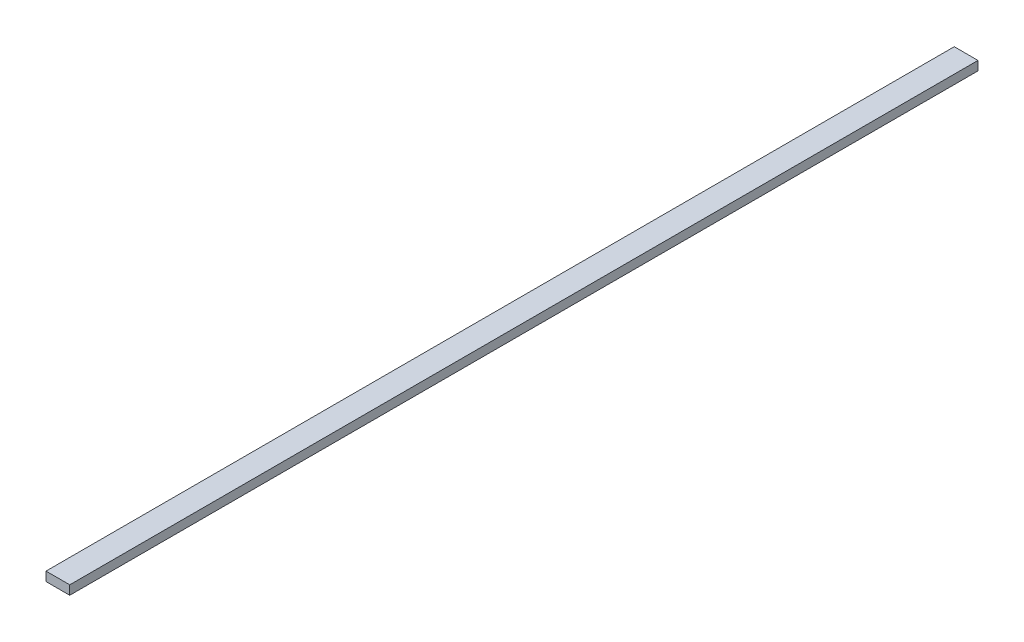
ISO-10303-21;
HEADER;
FILE_DESCRIPTION(('STEP AP214'),'2;1');
FILE_NAME('part.step','',(''),(''),'','','');
FILE_SCHEMA(('AUTOMOTIVE_DESIGN { 1 0 10303 214 1 1 1 1 }'));
ENDSEC;
DATA;
#1=APPLICATION_CONTEXT('core data for automotive mechanical design processes');
#2=APPLICATION_PROTOCOL_DEFINITION('international standard','automotive_design',2000,#1);
#3=PRODUCT_CONTEXT('',#1,'mechanical');
#4=PRODUCT('Part','Part','',(#3));
#5=PRODUCT_RELATED_PRODUCT_CATEGORY('part','',(#4));
#6=PRODUCT_DEFINITION_FORMATION('','',#4);
#7=PRODUCT_DEFINITION_CONTEXT('part definition',#1,'design');
#8=PRODUCT_DEFINITION('design','',#6,#7);
#9=PRODUCT_DEFINITION_SHAPE('','',#8);
#10=(LENGTH_UNIT() NAMED_UNIT(*) SI_UNIT(.MILLI.,.METRE.));
#11=(NAMED_UNIT(*) PLANE_ANGLE_UNIT() SI_UNIT($,.RADIAN.));
#12=(NAMED_UNIT(*) SI_UNIT($,.STERADIAN.) SOLID_ANGLE_UNIT());
#13=UNCERTAINTY_MEASURE_WITH_UNIT(LENGTH_MEASURE(1.E-05),#10,'distance_accuracy_value','');
#14=(GEOMETRIC_REPRESENTATION_CONTEXT(3) GLOBAL_UNCERTAINTY_ASSIGNED_CONTEXT((#13)) GLOBAL_UNIT_ASSIGNED_CONTEXT((#10,
#11,#12)) REPRESENTATION_CONTEXT('',''));
#15=CARTESIAN_POINT('',(0.,0.,0.));
#16=DIRECTION('',(0.,0.,1.));
#17=DIRECTION('',(1.,0.,0.));
#18=AXIS2_PLACEMENT_3D('',#15,#16,#17);
#19=CARTESIAN_POINT('',(9.15,-3.5,350.));
#20=DIRECTION('',(-1.,0.,0.));
#21=DIRECTION('',(0.,0.,1.));
#22=AXIS2_PLACEMENT_3D('',#19,#20,#21);
#23=PLANE('',#22);
#24=DIRECTION('',(0.,1.,0.));
#25=VECTOR('',#24,1.);
#26=CARTESIAN_POINT('',(9.15,-3.5,-350.));
#27=LINE('',#26,#25);
#28=CARTESIAN_POINT('',(9.15,-3.5,-350.));
#29=VERTEX_POINT('',#28);
#30=CARTESIAN_POINT('',(9.15,3.5,-350.));
#31=VERTEX_POINT('',#30);
#32=EDGE_CURVE('E98',#29,#31,#27,.T.);
#33=ORIENTED_EDGE('',*,*,#32,.T.);
#34=DIRECTION('',(0.,0.,-1.));
#35=VECTOR('',#34,1.);
#36=CARTESIAN_POINT('',(9.15,3.5,350.));
#37=LINE('',#36,#35);
#38=CARTESIAN_POINT('',(9.15,3.5,350.));
#39=VERTEX_POINT('',#38);
#40=EDGE_CURVE('E11',#39,#31,#37,.T.);
#41=ORIENTED_EDGE('',*,*,#40,.F.);
#42=DIRECTION('',(0.,1.,0.));
#43=VECTOR('',#42,1.);
#44=CARTESIAN_POINT('',(9.15,-3.5,350.));
#45=LINE('',#44,#43);
#46=CARTESIAN_POINT('',(9.15,-3.5,350.));
#47=VERTEX_POINT('',#46);
#48=EDGE_CURVE('E86',#47,#39,#45,.T.);
#49=ORIENTED_EDGE('',*,*,#48,.F.);
#50=DIRECTION('',(0.,0.,-1.));
#51=VECTOR('',#50,1.);
#52=CARTESIAN_POINT('',(9.15,-3.5,350.));
#53=LINE('',#52,#51);
#54=EDGE_CURVE('E94',#47,#29,#53,.T.);
#55=ORIENTED_EDGE('',*,*,#54,.T.);
#56=EDGE_LOOP('',(#33,#41,#49,#55));
#57=FACE_BOUND('',#56,.T.);
#58=ADVANCED_FACE('F35',(#57),#23,.F.);
#59=CARTESIAN_POINT('',(-9.15,3.5,350.));
#60=DIRECTION('',(0.,-1.,0.));
#61=DIRECTION('',(0.,0.,-1.));
#62=AXIS2_PLACEMENT_3D('',#59,#60,#61);
#63=PLANE('',#62);
#64=DIRECTION('',(-1.,0.,0.));
#65=VECTOR('',#64,1.);
#66=CARTESIAN_POINT('',(-9.15,3.5,-350.));
#67=LINE('',#66,#65);
#68=CARTESIAN_POINT('',(-9.15,3.5,-350.));
#69=VERTEX_POINT('',#68);
#70=EDGE_CURVE('E90',#31,#69,#67,.T.);
#71=ORIENTED_EDGE('',*,*,#70,.T.);
#72=DIRECTION('',(0.,0.,-1.));
#73=VECTOR('',#72,1.);
#74=CARTESIAN_POINT('',(-9.15,3.5,350.));
#75=LINE('',#74,#73);
#76=CARTESIAN_POINT('',(-9.15,3.5,350.));
#77=VERTEX_POINT('',#76);
#78=EDGE_CURVE('E43',#77,#69,#75,.T.);
#79=ORIENTED_EDGE('',*,*,#78,.F.);
#80=DIRECTION('',(-1.,0.,0.));
#81=VECTOR('',#80,1.);
#82=CARTESIAN_POINT('',(-9.15,3.5,350.));
#83=LINE('',#82,#81);
#84=EDGE_CURVE('E81',#39,#77,#83,.T.);
#85=ORIENTED_EDGE('',*,*,#84,.F.);
#86=ORIENTED_EDGE('',*,*,#40,.T.);
#87=EDGE_LOOP('',(#71,#79,#85,#86));
#88=FACE_BOUND('',#87,.T.);
#89=ADVANCED_FACE('F89',(#88),#63,.F.);
#90=CARTESIAN_POINT('',(-9.15,-3.5,350.));
#91=DIRECTION('',(1.,0.,0.));
#92=DIRECTION('',(0.,0.,-1.));
#93=AXIS2_PLACEMENT_3D('',#90,#91,#92);
#94=PLANE('',#93);
#95=DIRECTION('',(0.,-1.,0.));
#96=VECTOR('',#95,1.);
#97=CARTESIAN_POINT('',(-9.15,-3.5,-350.));
#98=LINE('',#97,#96);
#99=CARTESIAN_POINT('',(-9.15,-3.5,-350.));
#100=VERTEX_POINT('',#99);
#101=EDGE_CURVE('E68',#69,#100,#98,.T.);
#102=ORIENTED_EDGE('',*,*,#101,.T.);
#103=DIRECTION('',(0.,0.,-1.));
#104=VECTOR('',#103,1.);
#105=CARTESIAN_POINT('',(-9.15,-3.5,350.));
#106=LINE('',#105,#104);
#107=CARTESIAN_POINT('',(-9.15,-3.5,350.));
#108=VERTEX_POINT('',#107);
#109=EDGE_CURVE('E91',#108,#100,#106,.T.);
#110=ORIENTED_EDGE('',*,*,#109,.F.);
#111=DIRECTION('',(0.,-1.,0.));
#112=VECTOR('',#111,1.);
#113=CARTESIAN_POINT('',(-9.15,-3.5,350.));
#114=LINE('',#113,#112);
#115=EDGE_CURVE('E84',#77,#108,#114,.T.);
#116=ORIENTED_EDGE('',*,*,#115,.F.);
#117=ORIENTED_EDGE('',*,*,#78,.T.);
#118=EDGE_LOOP('',(#102,#110,#116,#117));
#119=FACE_BOUND('',#118,.T.);
#120=ADVANCED_FACE('F92',(#119),#94,.F.);
#121=CARTESIAN_POINT('',(-9.15,-3.5,350.));
#122=DIRECTION('',(0.,1.,0.));
#123=DIRECTION('',(0.,0.,1.));
#124=AXIS2_PLACEMENT_3D('',#121,#122,#123);
#125=PLANE('',#124);
#126=DIRECTION('',(1.,0.,0.));
#127=VECTOR('',#126,1.);
#128=CARTESIAN_POINT('',(-9.15,-3.5,-350.));
#129=LINE('',#128,#127);
#130=EDGE_CURVE('E74',#100,#29,#129,.T.);
#131=ORIENTED_EDGE('',*,*,#130,.T.);
#132=ORIENTED_EDGE('',*,*,#54,.F.);
#133=DIRECTION('',(1.,0.,0.));
#134=VECTOR('',#133,1.);
#135=CARTESIAN_POINT('',(-9.15,-3.5,350.));
#136=LINE('',#135,#134);
#137=EDGE_CURVE('E51',#108,#47,#136,.T.);
#138=ORIENTED_EDGE('',*,*,#137,.F.);
#139=ORIENTED_EDGE('',*,*,#109,.T.);
#140=EDGE_LOOP('',(#131,#132,#138,#139));
#141=FACE_BOUND('',#140,.T.);
#142=ADVANCED_FACE('F105',(#141),#125,.F.);
#143=CARTESIAN_POINT('',(0.,0.,350.));
#144=DIRECTION('',(0.,0.,-1.));
#145=DIRECTION('',(-1.,0.,0.));
#146=AXIS2_PLACEMENT_3D('',#143,#144,#145);
#147=PLANE('',#146);
#148=ORIENTED_EDGE('',*,*,#48,.T.);
#149=ORIENTED_EDGE('',*,*,#84,.T.);
#150=ORIENTED_EDGE('',*,*,#115,.T.);
#151=ORIENTED_EDGE('',*,*,#137,.T.);
#152=EDGE_LOOP('',(#148,#149,#150,#151));
#153=FACE_BOUND('',#152,.T.);
#154=ADVANCED_FACE('F82',(#153),#147,.F.);
#155=CARTESIAN_POINT('',(0.,0.,-350.));
#156=DIRECTION('',(0.,0.,-1.));
#157=DIRECTION('',(-1.,0.,0.));
#158=AXIS2_PLACEMENT_3D('',#155,#156,#157);
#159=PLANE('',#158);
#160=ORIENTED_EDGE('',*,*,#32,.F.);
#161=ORIENTED_EDGE('',*,*,#130,.F.);
#162=ORIENTED_EDGE('',*,*,#101,.F.);
#163=ORIENTED_EDGE('',*,*,#70,.F.);
#164=EDGE_LOOP('',(#160,#161,#162,#163));
#165=FACE_BOUND('',#164,.T.);
#166=ADVANCED_FACE('F108',(#165),#159,.T.);
#167=CLOSED_SHELL('',(#58,#89,#120,#142,#154,#166));
#168=MANIFOLD_SOLID_BREP('B2',#167);
#169=ADVANCED_BREP_SHAPE_REPRESENTATION('',(#18,#168),#14);
#170=SHAPE_DEFINITION_REPRESENTATION(#9,#169);
ENDSEC;
END-ISO-10303-21;
